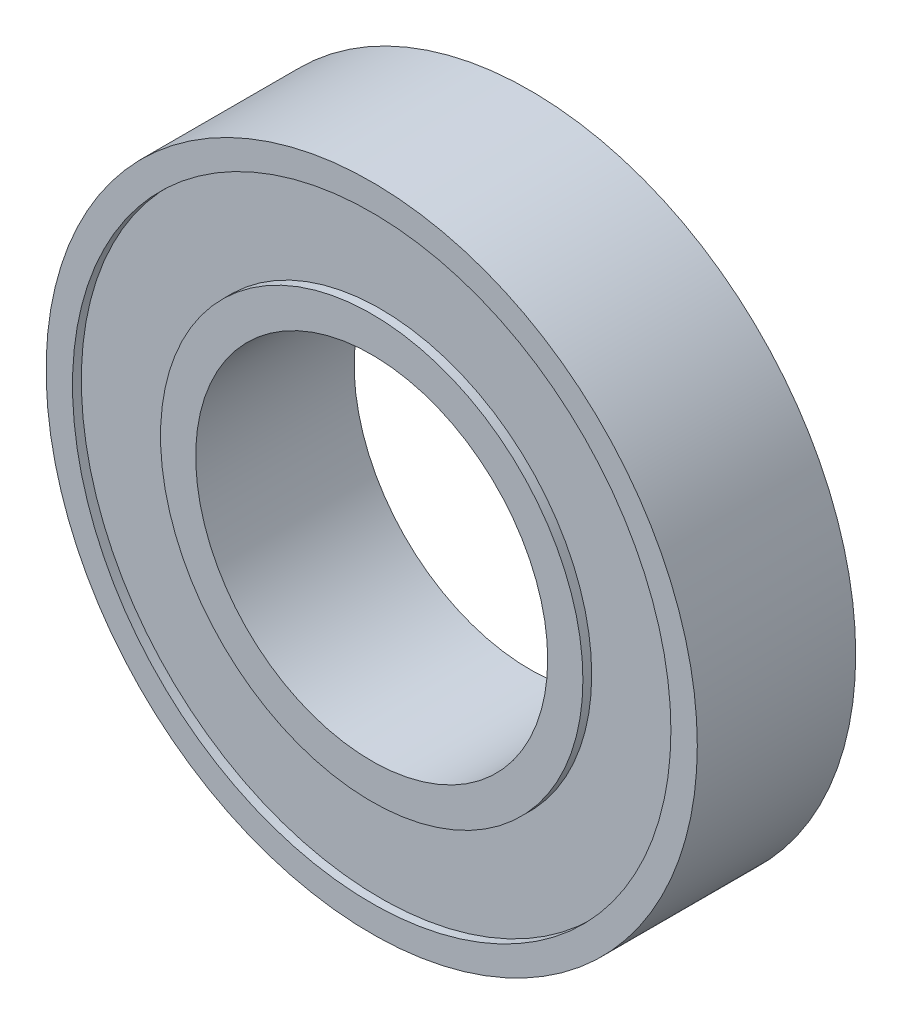
ISO-10303-21;
HEADER;
FILE_DESCRIPTION(('STEP AP214'),'2;1');
FILE_NAME('part.step','',(''),(''),'','','');
FILE_SCHEMA(('AUTOMOTIVE_DESIGN { 1 0 10303 214 1 1 1 1 }'));
ENDSEC;
DATA;
#1=APPLICATION_CONTEXT('core data for automotive mechanical design processes');
#2=APPLICATION_PROTOCOL_DEFINITION('international standard','automotive_design',2000,#1);
#3=PRODUCT_CONTEXT('',#1,'mechanical');
#4=PRODUCT('Part','Part','',(#3));
#5=PRODUCT_RELATED_PRODUCT_CATEGORY('part','',(#4));
#6=PRODUCT_DEFINITION_FORMATION('','',#4);
#7=PRODUCT_DEFINITION_CONTEXT('part definition',#1,'design');
#8=PRODUCT_DEFINITION('design','',#6,#7);
#9=PRODUCT_DEFINITION_SHAPE('','',#8);
#10=(LENGTH_UNIT() NAMED_UNIT(*) SI_UNIT(.MILLI.,.METRE.));
#11=(NAMED_UNIT(*) PLANE_ANGLE_UNIT() SI_UNIT($,.RADIAN.));
#12=(NAMED_UNIT(*) SI_UNIT($,.STERADIAN.) SOLID_ANGLE_UNIT());
#13=UNCERTAINTY_MEASURE_WITH_UNIT(LENGTH_MEASURE(1.E-05),#10,'distance_accuracy_value','');
#14=(GEOMETRIC_REPRESENTATION_CONTEXT(3) GLOBAL_UNCERTAINTY_ASSIGNED_CONTEXT((#13)) GLOBAL_UNIT_ASSIGNED_CONTEXT((#10,
#11,#12)) REPRESENTATION_CONTEXT('',''));
#15=CARTESIAN_POINT('',(0.,0.,0.));
#16=DIRECTION('',(0.,0.,1.));
#17=DIRECTION('',(1.,0.,0.));
#18=AXIS2_PLACEMENT_3D('',#15,#16,#17);
#19=CARTESIAN_POINT('',(0.,0.,-4.5));
#20=DIRECTION('',(0.,0.,1.));
#21=DIRECTION('',(1.,0.,0.));
#22=AXIS2_PLACEMENT_3D('',#19,#20,#21);
#23=PLANE('',#22);
#24=CARTESIAN_POINT('',(0.,0.,-4.5));
#25=DIRECTION('',(0.,0.,1.));
#26=DIRECTION('',(1.,0.,0.));
#27=AXIS2_PLACEMENT_3D('',#24,#25,#26);
#28=CIRCLE('',#27,10.);
#29=CARTESIAN_POINT('',(10.,0.,-4.5));
#30=VERTEX_POINT('',#29);
#31=EDGE_CURVE('E46',#30,#30,#28,.T.);
#32=ORIENTED_EDGE('',*,*,#31,.T.);
#33=EDGE_LOOP('',(#32));
#34=FACE_BOUND('',#33,.T.);
#35=CARTESIAN_POINT('',(0.,0.,-4.5));
#36=DIRECTION('',(0.,0.,1.));
#37=DIRECTION('',(1.,0.,0.));
#38=AXIS2_PLACEMENT_3D('',#35,#36,#37);
#39=CIRCLE('',#38,12.);
#40=CARTESIAN_POINT('',(12.,0.,-4.5));
#41=VERTEX_POINT('',#40);
#42=EDGE_CURVE('E72',#41,#41,#39,.T.);
#43=ORIENTED_EDGE('',*,*,#42,.F.);
#44=EDGE_LOOP('',(#43));
#45=FACE_BOUND('',#44,.T.);
#46=ADVANCED_FACE('F35',(#34,#45),#23,.F.);
#47=CARTESIAN_POINT('',(0.,0.,4.5));
#48=DIRECTION('',(0.,0.,1.));
#49=DIRECTION('',(1.,0.,0.));
#50=AXIS2_PLACEMENT_3D('',#47,#48,#49);
#51=PLANE('',#50);
#52=CARTESIAN_POINT('',(0.,0.,4.5));
#53=DIRECTION('',(0.,0.,1.));
#54=DIRECTION('',(1.,0.,0.));
#55=AXIS2_PLACEMENT_3D('',#52,#53,#54);
#56=CIRCLE('',#55,10.);
#57=CARTESIAN_POINT('',(10.,0.,4.5));
#58=VERTEX_POINT('',#57);
#59=EDGE_CURVE('E48',#58,#58,#56,.T.);
#60=ORIENTED_EDGE('',*,*,#59,.F.);
#61=EDGE_LOOP('',(#60));
#62=FACE_BOUND('',#61,.T.);
#63=CARTESIAN_POINT('',(0.,0.,4.5));
#64=DIRECTION('',(0.,0.,1.));
#65=DIRECTION('',(1.,0.,0.));
#66=AXIS2_PLACEMENT_3D('',#63,#64,#65);
#67=CIRCLE('',#66,12.);
#68=CARTESIAN_POINT('',(12.,0.,4.5));
#69=VERTEX_POINT('',#68);
#70=EDGE_CURVE('E60',#69,#69,#67,.T.);
#71=ORIENTED_EDGE('',*,*,#70,.T.);
#72=EDGE_LOOP('',(#71));
#73=FACE_BOUND('',#72,.T.);
#74=ADVANCED_FACE('F88',(#62,#73),#51,.T.);
#75=CARTESIAN_POINT('',(0.,0.,4.5));
#76=DIRECTION('',(0.,0.,-1.));
#77=DIRECTION('',(-1.,0.,0.));
#78=AXIS2_PLACEMENT_3D('',#75,#76,#77);
#79=CYLINDRICAL_SURFACE('',#78,18.5);
#80=CARTESIAN_POINT('',(0.,0.,4.5));
#81=DIRECTION('',(0.,0.,1.));
#82=DIRECTION('',(1.,0.,0.));
#83=AXIS2_PLACEMENT_3D('',#80,#81,#82);
#84=CIRCLE('',#83,18.5);
#85=CARTESIAN_POINT('',(18.5,0.,4.5));
#86=VERTEX_POINT('',#85);
#87=EDGE_CURVE('E10',#86,#86,#84,.T.);
#88=ORIENTED_EDGE('',*,*,#87,.F.);
#89=EDGE_LOOP('',(#88));
#90=FACE_BOUND('',#89,.T.);
#91=CARTESIAN_POINT('',(0.,0.,-4.5));
#92=DIRECTION('',(0.,0.,1.));
#93=DIRECTION('',(1.,0.,0.));
#94=AXIS2_PLACEMENT_3D('',#91,#92,#93);
#95=CIRCLE('',#94,18.5);
#96=CARTESIAN_POINT('',(18.5,0.,-4.5));
#97=VERTEX_POINT('',#96);
#98=EDGE_CURVE('E39',#97,#97,#95,.T.);
#99=ORIENTED_EDGE('',*,*,#98,.T.);
#100=EDGE_LOOP('',(#99));
#101=FACE_BOUND('',#100,.T.);
#102=ADVANCED_FACE('F37',(#90,#101),#79,.T.);
#103=CARTESIAN_POINT('',(0.,0.,4.5));
#104=DIRECTION('',(0.,0.,1.));
#105=DIRECTION('',(1.,0.,0.));
#106=AXIS2_PLACEMENT_3D('',#103,#104,#105);
#107=CIRCLE('',#106,17.);
#108=CARTESIAN_POINT('',(17.,0.,4.5));
#109=VERTEX_POINT('',#108);
#110=EDGE_CURVE('E54',#109,#109,#107,.T.);
#111=ORIENTED_EDGE('',*,*,#110,.F.);
#112=EDGE_LOOP('',(#111));
#113=FACE_BOUND('',#112,.T.);
#114=ORIENTED_EDGE('',*,*,#87,.T.);
#115=EDGE_LOOP('',(#114));
#116=FACE_BOUND('',#115,.T.);
#117=ADVANCED_FACE('F96',(#113,#116),#51,.T.);
#118=CARTESIAN_POINT('',(0.,0.,-4.5));
#119=DIRECTION('',(0.,0.,1.));
#120=DIRECTION('',(1.,0.,0.));
#121=AXIS2_PLACEMENT_3D('',#118,#119,#120);
#122=CIRCLE('',#121,17.);
#123=CARTESIAN_POINT('',(17.,0.,-4.5));
#124=VERTEX_POINT('',#123);
#125=EDGE_CURVE('E66',#124,#124,#122,.T.);
#126=ORIENTED_EDGE('',*,*,#125,.T.);
#127=EDGE_LOOP('',(#126));
#128=FACE_BOUND('',#127,.T.);
#129=ORIENTED_EDGE('',*,*,#98,.F.);
#130=EDGE_LOOP('',(#129));
#131=FACE_BOUND('',#130,.T.);
#132=ADVANCED_FACE('F90',(#128,#131),#23,.F.);
#133=CARTESIAN_POINT('',(0.,0.,-4.5));
#134=DIRECTION('',(0.,0.,1.));
#135=DIRECTION('',(1.,0.,0.));
#136=AXIS2_PLACEMENT_3D('',#133,#134,#135);
#137=CYLINDRICAL_SURFACE('',#136,10.);
#138=ORIENTED_EDGE('',*,*,#31,.F.);
#139=EDGE_LOOP('',(#138));
#140=FACE_BOUND('',#139,.T.);
#141=ORIENTED_EDGE('',*,*,#59,.T.);
#142=EDGE_LOOP('',(#141));
#143=FACE_BOUND('',#142,.T.);
#144=ADVANCED_FACE('F98',(#140,#143),#137,.F.);
#145=CARTESIAN_POINT('',(0.,0.,4.));
#146=DIRECTION('',(0.,0.,1.));
#147=DIRECTION('',(1.,0.,0.));
#148=AXIS2_PLACEMENT_3D('',#145,#146,#147);
#149=CYLINDRICAL_SURFACE('',#148,17.);
#150=CARTESIAN_POINT('',(0.,0.,4.));
#151=DIRECTION('',(0.,0.,1.));
#152=DIRECTION('',(1.,0.,0.));
#153=AXIS2_PLACEMENT_3D('',#150,#151,#152);
#154=CIRCLE('',#153,17.);
#155=CARTESIAN_POINT('',(17.,0.,4.));
#156=VERTEX_POINT('',#155);
#157=EDGE_CURVE('E51',#156,#156,#154,.T.);
#158=ORIENTED_EDGE('',*,*,#157,.F.);
#159=EDGE_LOOP('',(#158));
#160=FACE_BOUND('',#159,.T.);
#161=ORIENTED_EDGE('',*,*,#110,.T.);
#162=EDGE_LOOP('',(#161));
#163=FACE_BOUND('',#162,.T.);
#164=ADVANCED_FACE('F104',(#160,#163),#149,.F.);
#165=CARTESIAN_POINT('',(0.,0.,4.));
#166=DIRECTION('',(0.,0.,1.));
#167=DIRECTION('',(1.,0.,0.));
#168=AXIS2_PLACEMENT_3D('',#165,#166,#167);
#169=PLANE('',#168);
#170=CARTESIAN_POINT('',(0.,0.,4.));
#171=DIRECTION('',(0.,0.,1.));
#172=DIRECTION('',(1.,0.,0.));
#173=AXIS2_PLACEMENT_3D('',#170,#171,#172);
#174=CIRCLE('',#173,12.);
#175=CARTESIAN_POINT('',(12.,0.,4.));
#176=VERTEX_POINT('',#175);
#177=EDGE_CURVE('E57',#176,#176,#174,.T.);
#178=ORIENTED_EDGE('',*,*,#177,.F.);
#179=EDGE_LOOP('',(#178));
#180=FACE_BOUND('',#179,.T.);
#181=ORIENTED_EDGE('',*,*,#157,.T.);
#182=EDGE_LOOP('',(#181));
#183=FACE_BOUND('',#182,.T.);
#184=ADVANCED_FACE('F135',(#180,#183),#169,.T.);
#185=CARTESIAN_POINT('',(0.,0.,4.));
#186=DIRECTION('',(0.,0.,1.));
#187=DIRECTION('',(1.,0.,0.));
#188=AXIS2_PLACEMENT_3D('',#185,#186,#187);
#189=CYLINDRICAL_SURFACE('',#188,12.);
#190=ORIENTED_EDGE('',*,*,#177,.T.);
#191=EDGE_LOOP('',(#190));
#192=FACE_BOUND('',#191,.T.);
#193=ORIENTED_EDGE('',*,*,#70,.F.);
#194=EDGE_LOOP('',(#193));
#195=FACE_BOUND('',#194,.T.);
#196=ADVANCED_FACE('F145',(#192,#195),#189,.T.);
#197=CARTESIAN_POINT('',(0.,0.,-4.));
#198=DIRECTION('',(0.,0.,-1.));
#199=DIRECTION('',(1.,0.,0.));
#200=AXIS2_PLACEMENT_3D('',#197,#198,#199);
#201=PLANE('',#200);
#202=CARTESIAN_POINT('',(0.,0.,-4.));
#203=DIRECTION('',(0.,0.,1.));
#204=DIRECTION('',(1.,0.,0.));
#205=AXIS2_PLACEMENT_3D('',#202,#203,#204);
#206=CIRCLE('',#205,17.);
#207=CARTESIAN_POINT('',(17.,0.,-4.));
#208=VERTEX_POINT('',#207);
#209=EDGE_CURVE('E63',#208,#208,#206,.T.);
#210=ORIENTED_EDGE('',*,*,#209,.F.);
#211=EDGE_LOOP('',(#210));
#212=FACE_BOUND('',#211,.T.);
#213=CARTESIAN_POINT('',(0.,0.,-4.));
#214=DIRECTION('',(0.,0.,1.));
#215=DIRECTION('',(1.,0.,0.));
#216=AXIS2_PLACEMENT_3D('',#213,#214,#215);
#217=CIRCLE('',#216,12.);
#218=CARTESIAN_POINT('',(12.,0.,-4.));
#219=VERTEX_POINT('',#218);
#220=EDGE_CURVE('E69',#219,#219,#217,.T.);
#221=ORIENTED_EDGE('',*,*,#220,.T.);
#222=EDGE_LOOP('',(#221));
#223=FACE_BOUND('',#222,.T.);
#224=ADVANCED_FACE('F78',(#212,#223),#201,.T.);
#225=CARTESIAN_POINT('',(0.,0.,-4.));
#226=DIRECTION('',(0.,0.,-1.));
#227=DIRECTION('',(-1.,0.,0.));
#228=AXIS2_PLACEMENT_3D('',#225,#226,#227);
#229=CYLINDRICAL_SURFACE('',#228,17.);
#230=ORIENTED_EDGE('',*,*,#209,.T.);
#231=EDGE_LOOP('',(#230));
#232=FACE_BOUND('',#231,.T.);
#233=ORIENTED_EDGE('',*,*,#125,.F.);
#234=EDGE_LOOP('',(#233));
#235=FACE_BOUND('',#234,.T.);
#236=ADVANCED_FACE('F83',(#232,#235),#229,.F.);
#237=CARTESIAN_POINT('',(0.,0.,-4.));
#238=DIRECTION('',(0.,0.,-1.));
#239=DIRECTION('',(-1.,0.,0.));
#240=AXIS2_PLACEMENT_3D('',#237,#238,#239);
#241=CYLINDRICAL_SURFACE('',#240,12.);
#242=ORIENTED_EDGE('',*,*,#220,.F.);
#243=EDGE_LOOP('',(#242));
#244=FACE_BOUND('',#243,.T.);
#245=ORIENTED_EDGE('',*,*,#42,.T.);
#246=EDGE_LOOP('',(#245));
#247=FACE_BOUND('',#246,.T.);
#248=ADVANCED_FACE('F80',(#244,#247),#241,.T.);
#249=CLOSED_SHELL('',(#46,#74,#102,#117,#132,#144,#164,#184,#196,#224,#236,#248));
#250=MANIFOLD_SOLID_BREP('B2',#249);
#251=ADVANCED_BREP_SHAPE_REPRESENTATION('',(#18,#250),#14);
#252=SHAPE_DEFINITION_REPRESENTATION(#9,#251);
ENDSEC;
END-ISO-10303-21;
